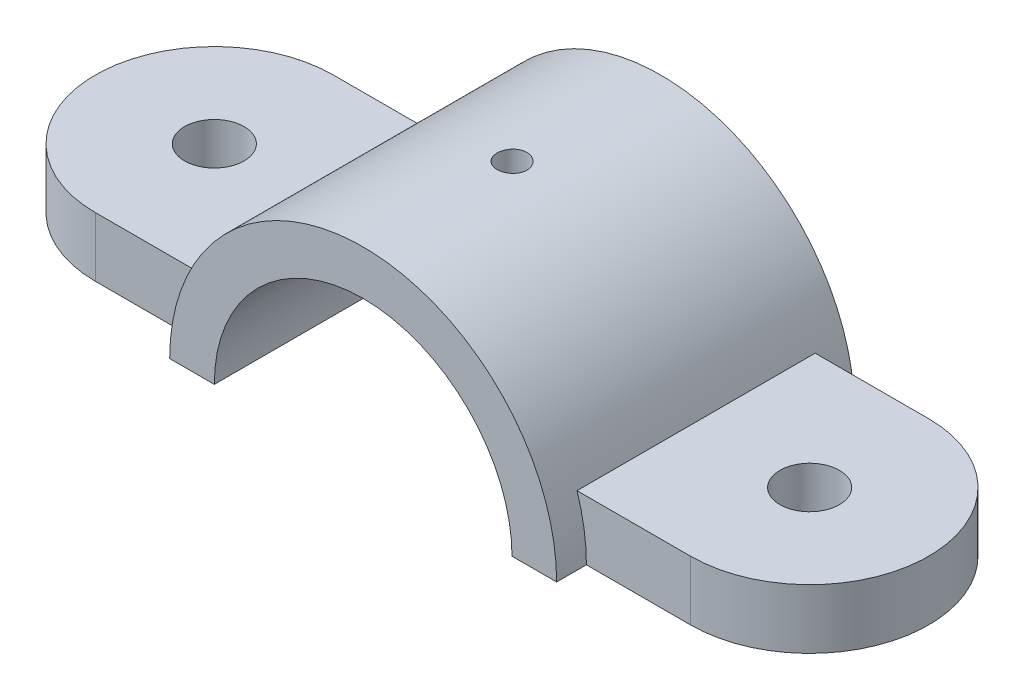
ISO-10303-21;
HEADER;
FILE_DESCRIPTION(('STEP AP214'),'2;1');
FILE_NAME('part.step','',(''),(''),'','','');
FILE_SCHEMA(('AUTOMOTIVE_DESIGN { 1 0 10303 214 1 1 1 1 }'));
ENDSEC;
DATA;
#1=APPLICATION_CONTEXT('core data for automotive mechanical design processes');
#2=APPLICATION_PROTOCOL_DEFINITION('international standard','automotive_design',2000,#1);
#3=PRODUCT_CONTEXT('',#1,'mechanical');
#4=PRODUCT('Part','Part','',(#3));
#5=PRODUCT_RELATED_PRODUCT_CATEGORY('part','',(#4));
#6=PRODUCT_DEFINITION_FORMATION('','',#4);
#7=PRODUCT_DEFINITION_CONTEXT('part definition',#1,'design');
#8=PRODUCT_DEFINITION('design','',#6,#7);
#9=PRODUCT_DEFINITION_SHAPE('','',#8);
#10=(LENGTH_UNIT() NAMED_UNIT(*) SI_UNIT(.MILLI.,.METRE.));
#11=(NAMED_UNIT(*) PLANE_ANGLE_UNIT() SI_UNIT($,.RADIAN.));
#12=(NAMED_UNIT(*) SI_UNIT($,.STERADIAN.) SOLID_ANGLE_UNIT());
#13=UNCERTAINTY_MEASURE_WITH_UNIT(LENGTH_MEASURE(1.E-05),#10,'distance_accuracy_value','');
#14=(GEOMETRIC_REPRESENTATION_CONTEXT(3) GLOBAL_UNCERTAINTY_ASSIGNED_CONTEXT((#13)) GLOBAL_UNIT_ASSIGNED_CONTEXT((#10,
#11,#12)) REPRESENTATION_CONTEXT('',''));
#15=CARTESIAN_POINT('',(0.,0.,0.));
#16=DIRECTION('',(0.,0.,1.));
#17=DIRECTION('',(1.,0.,0.));
#18=AXIS2_PLACEMENT_3D('',#15,#16,#17);
#19=CARTESIAN_POINT('',(-63.5,0.,0.));
#20=DIRECTION('',(0.,1.,0.));
#21=DIRECTION('',(0.,0.,1.));
#22=AXIS2_PLACEMENT_3D('',#19,#20,#21);
#23=PLANE('',#22);
#24=CARTESIAN_POINT('',(-63.5,0.,0.));
#25=DIRECTION('',(0.,1.,0.));
#26=DIRECTION('',(0.,0.,1.));
#27=AXIS2_PLACEMENT_3D('',#24,#25,#26);
#28=CIRCLE('',#27,6.35);
#29=CARTESIAN_POINT('',(-63.5,0.,6.35));
#30=VERTEX_POINT('',#29);
#31=EDGE_CURVE('E176',#30,#30,#28,.T.);
#32=ORIENTED_EDGE('',*,*,#31,.T.);
#33=EDGE_LOOP('',(#32));
#34=FACE_BOUND('',#33,.T.);
#35=DIRECTION('',(1.,0.,0.));
#36=VECTOR('',#35,1.);
#37=CARTESIAN_POINT('',(-41.275,0.,-31.75));
#38=LINE('',#37,#36);
#39=CARTESIAN_POINT('',(-41.275,0.,-31.75));
#40=VERTEX_POINT('',#39);
#41=CARTESIAN_POINT('',(-31.75,0.,-31.75));
#42=VERTEX_POINT('',#41);
#43=EDGE_CURVE('E151',#40,#42,#38,.T.);
#44=ORIENTED_EDGE('',*,*,#43,.T.);
#45=DIRECTION('',(0.,0.,1.));
#46=VECTOR('',#45,1.);
#47=CARTESIAN_POINT('',(-31.75,0.,-31.75));
#48=LINE('',#47,#46);
#49=CARTESIAN_POINT('',(-31.75,0.,31.75));
#50=VERTEX_POINT('',#49);
#51=EDGE_CURVE('E54',#42,#50,#48,.T.);
#52=ORIENTED_EDGE('',*,*,#51,.T.);
#53=DIRECTION('',(1.,0.,0.));
#54=VECTOR('',#53,1.);
#55=CARTESIAN_POINT('',(-41.275,0.,31.75));
#56=LINE('',#55,#54);
#57=CARTESIAN_POINT('',(-41.275,0.,31.75));
#58=VERTEX_POINT('',#57);
#59=EDGE_CURVE('E226',#58,#50,#56,.T.);
#60=ORIENTED_EDGE('',*,*,#59,.F.);
#61=DIRECTION('',(0.,0.,-1.));
#62=VECTOR('',#61,1.);
#63=CARTESIAN_POINT('',(-41.275,0.,31.75));
#64=LINE('',#63,#62);
#65=CARTESIAN_POINT('',(-41.275,0.,25.4));
#66=VERTEX_POINT('',#65);
#67=EDGE_CURVE('E162',#58,#66,#64,.T.);
#68=ORIENTED_EDGE('',*,*,#67,.T.);
#69=DIRECTION('',(1.,0.,0.));
#70=VECTOR('',#69,1.);
#71=CARTESIAN_POINT('',(-63.5,0.,25.4));
#72=LINE('',#71,#70);
#73=CARTESIAN_POINT('',(-63.5,0.,25.4));
#74=VERTEX_POINT('',#73);
#75=EDGE_CURVE('E202',#74,#66,#72,.T.);
#76=ORIENTED_EDGE('',*,*,#75,.F.);
#77=CARTESIAN_POINT('',(-63.5,0.,0.));
#78=DIRECTION('',(0.,1.,0.));
#79=DIRECTION('',(0.,0.,1.));
#80=AXIS2_PLACEMENT_3D('',#77,#78,#79);
#81=CIRCLE('',#80,25.4);
#82=CARTESIAN_POINT('',(-63.5,0.,-25.4));
#83=VERTEX_POINT('',#82);
#84=EDGE_CURVE('E182',#83,#74,#81,.T.);
#85=ORIENTED_EDGE('',*,*,#84,.F.);
#86=DIRECTION('',(-1.,0.,0.));
#87=VECTOR('',#86,1.);
#88=CARTESIAN_POINT('',(-63.5,0.,-25.4));
#89=LINE('',#88,#87);
#90=CARTESIAN_POINT('',(-41.275,0.,-25.4));
#91=VERTEX_POINT('',#90);
#92=EDGE_CURVE('E206',#91,#83,#89,.T.);
#93=ORIENTED_EDGE('',*,*,#92,.F.);
#94=EDGE_CURVE('E160',#91,#40,#64,.T.);
#95=ORIENTED_EDGE('',*,*,#94,.T.);
#96=EDGE_LOOP('',(#44,#52,#60,#68,#76,#85,#93,#95));
#97=FACE_BOUND('',#96,.T.);
#98=ADVANCED_FACE('F33',(#34,#97),#23,.F.);
#99=CARTESIAN_POINT('',(-63.5,12.7,0.));
#100=DIRECTION('',(0.,1.,0.));
#101=DIRECTION('',(0.,0.,1.));
#102=AXIS2_PLACEMENT_3D('',#99,#100,#101);
#103=PLANE('',#102);
#104=CARTESIAN_POINT('',(63.5,12.7,0.));
#105=DIRECTION('',(0.,1.,0.));
#106=DIRECTION('',(0.,0.,1.));
#107=AXIS2_PLACEMENT_3D('',#104,#105,#106);
#108=CIRCLE('',#107,6.35);
#109=CARTESIAN_POINT('',(63.5,12.7,6.35));
#110=VERTEX_POINT('',#109);
#111=EDGE_CURVE('E179',#110,#110,#108,.T.);
#112=ORIENTED_EDGE('',*,*,#111,.F.);
#113=EDGE_LOOP('',(#112));
#114=FACE_BOUND('',#113,.T.);
#115=DIRECTION('',(-1.,0.,0.));
#116=VECTOR('',#115,1.);
#117=CARTESIAN_POINT('',(-63.5,12.7,-25.4));
#118=LINE('',#117,#116);
#119=CARTESIAN_POINT('',(63.5,12.7,-25.4));
#120=VERTEX_POINT('',#119);
#121=CARTESIAN_POINT('',(39.2725810840082,12.7,-25.4));
#122=VERTEX_POINT('',#121);
#123=EDGE_CURVE('E196',#120,#122,#118,.T.);
#124=ORIENTED_EDGE('',*,*,#123,.T.);
#125=DIRECTION('',(0.,0.,-1.));
#126=VECTOR('',#125,1.);
#127=CARTESIAN_POINT('',(39.2725810840082,12.7,31.75));
#128=LINE('',#127,#126);
#129=CARTESIAN_POINT('',(39.2725810840082,12.7,25.4));
#130=VERTEX_POINT('',#129);
#131=EDGE_CURVE('E62',#122,#130,#128,.F.);
#132=ORIENTED_EDGE('',*,*,#131,.T.);
#133=DIRECTION('',(1.,0.,0.));
#134=VECTOR('',#133,1.);
#135=CARTESIAN_POINT('',(-63.5,12.7,25.4));
#136=LINE('',#135,#134);
#137=CARTESIAN_POINT('',(63.5,12.7,25.4));
#138=VERTEX_POINT('',#137);
#139=EDGE_CURVE('E188',#130,#138,#136,.T.);
#140=ORIENTED_EDGE('',*,*,#139,.T.);
#141=CARTESIAN_POINT('',(63.5,12.7,0.));
#142=DIRECTION('',(0.,1.,0.));
#143=DIRECTION('',(0.,0.,1.));
#144=AXIS2_PLACEMENT_3D('',#141,#142,#143);
#145=CIRCLE('',#144,25.4);
#146=EDGE_CURVE('E193',#138,#120,#145,.T.);
#147=ORIENTED_EDGE('',*,*,#146,.T.);
#148=EDGE_LOOP('',(#124,#132,#140,#147));
#149=FACE_BOUND('',#148,.T.);
#150=ADVANCED_FACE('F258',(#114,#149),#103,.T.);
#151=CARTESIAN_POINT('',(-63.5,12.7,0.));
#152=DIRECTION('',(0.,1.,0.));
#153=DIRECTION('',(0.,0.,1.));
#154=AXIS2_PLACEMENT_3D('',#151,#152,#153);
#155=CIRCLE('',#154,6.35);
#156=CARTESIAN_POINT('',(-63.5,12.7,6.35));
#157=VERTEX_POINT('',#156);
#158=EDGE_CURVE('E172',#157,#157,#155,.T.);
#159=ORIENTED_EDGE('',*,*,#158,.F.);
#160=EDGE_LOOP('',(#159));
#161=FACE_BOUND('',#160,.T.);
#162=CARTESIAN_POINT('',(-63.5,12.7,25.4));
#163=VERTEX_POINT('',#162);
#164=CARTESIAN_POINT('',(-39.2725810840082,12.7,25.4));
#165=VERTEX_POINT('',#164);
#166=EDGE_CURVE('E190',#163,#165,#136,.T.);
#167=ORIENTED_EDGE('',*,*,#166,.T.);
#168=DIRECTION('',(0.,0.,-1.));
#169=VECTOR('',#168,1.);
#170=CARTESIAN_POINT('',(-39.2725810840082,12.7,31.75));
#171=LINE('',#170,#169);
#172=CARTESIAN_POINT('',(-39.2725810840082,12.7,-25.4));
#173=VERTEX_POINT('',#172);
#174=EDGE_CURVE('E169',#165,#173,#171,.T.);
#175=ORIENTED_EDGE('',*,*,#174,.T.);
#176=CARTESIAN_POINT('',(-63.5,12.7,-25.4));
#177=VERTEX_POINT('',#176);
#178=EDGE_CURVE('E195',#173,#177,#118,.T.);
#179=ORIENTED_EDGE('',*,*,#178,.T.);
#180=CARTESIAN_POINT('',(-63.5,12.7,0.));
#181=DIRECTION('',(0.,1.,0.));
#182=DIRECTION('',(0.,0.,1.));
#183=AXIS2_PLACEMENT_3D('',#180,#181,#182);
#184=CIRCLE('',#183,25.4);
#185=EDGE_CURVE('E185',#177,#163,#184,.T.);
#186=ORIENTED_EDGE('',*,*,#185,.T.);
#187=EDGE_LOOP('',(#167,#175,#179,#186));
#188=FACE_BOUND('',#187,.T.);
#189=ADVANCED_FACE('F264',(#161,#188),#103,.T.);
#190=CARTESIAN_POINT('',(-63.5,12.7,25.4));
#191=DIRECTION('',(0.,0.,-1.));
#192=DIRECTION('',(-1.,0.,0.));
#193=AXIS2_PLACEMENT_3D('',#190,#191,#192);
#194=PLANE('',#193);
#195=CARTESIAN_POINT('',(0.,0.,25.4));
#196=DIRECTION('',(0.,0.,-1.));
#197=DIRECTION('',(-1.,0.,0.));
#198=AXIS2_PLACEMENT_3D('',#195,#196,#197);
#199=CIRCLE('',#198,41.275);
#200=CARTESIAN_POINT('',(41.275,0.,25.4));
#201=VERTEX_POINT('',#200);
#202=EDGE_CURVE('E166',#201,#130,#199,.F.);
#203=ORIENTED_EDGE('',*,*,#202,.F.);
#204=CARTESIAN_POINT('',(63.5,0.,25.4));
#205=VERTEX_POINT('',#204);
#206=EDGE_CURVE('E201',#201,#205,#72,.T.);
#207=ORIENTED_EDGE('',*,*,#206,.T.);
#208=DIRECTION('',(0.,-1.,0.));
#209=VECTOR('',#208,1.);
#210=CARTESIAN_POINT('',(63.5,12.7,25.4));
#211=LINE('',#210,#209);
#212=EDGE_CURVE('E213',#138,#205,#211,.T.);
#213=ORIENTED_EDGE('',*,*,#212,.F.);
#214=ORIENTED_EDGE('',*,*,#139,.F.);
#215=EDGE_LOOP('',(#203,#207,#213,#214));
#216=FACE_BOUND('',#215,.T.);
#217=ADVANCED_FACE('F287',(#216),#194,.F.);
#218=EDGE_CURVE('E170',#165,#66,#199,.F.);
#219=ORIENTED_EDGE('',*,*,#218,.F.);
#220=ORIENTED_EDGE('',*,*,#166,.F.);
#221=DIRECTION('',(0.,-1.,0.));
#222=VECTOR('',#221,1.);
#223=CARTESIAN_POINT('',(-63.5,12.7,25.4));
#224=LINE('',#223,#222);
#225=EDGE_CURVE('E216',#163,#74,#224,.T.);
#226=ORIENTED_EDGE('',*,*,#225,.T.);
#227=ORIENTED_EDGE('',*,*,#75,.T.);
#228=EDGE_LOOP('',(#219,#220,#226,#227));
#229=FACE_BOUND('',#228,.T.);
#230=ADVANCED_FACE('F281',(#229),#194,.F.);
#231=CARTESIAN_POINT('',(-63.5,12.7,-25.4));
#232=DIRECTION('',(0.,0.,1.));
#233=DIRECTION('',(1.,0.,0.));
#234=AXIS2_PLACEMENT_3D('',#231,#232,#233);
#235=PLANE('',#234);
#236=CARTESIAN_POINT('',(0.,0.,-25.4));
#237=DIRECTION('',(0.,0.,1.));
#238=DIRECTION('',(1.,0.,0.));
#239=AXIS2_PLACEMENT_3D('',#236,#237,#238);
#240=CIRCLE('',#239,41.275);
#241=EDGE_CURVE('E11',#91,#173,#240,.F.);
#242=ORIENTED_EDGE('',*,*,#241,.F.);
#243=ORIENTED_EDGE('',*,*,#92,.T.);
#244=DIRECTION('',(0.,-1.,0.));
#245=VECTOR('',#244,1.);
#246=CARTESIAN_POINT('',(-63.5,12.7,-25.4));
#247=LINE('',#246,#245);
#248=EDGE_CURVE('E198',#177,#83,#247,.T.);
#249=ORIENTED_EDGE('',*,*,#248,.F.);
#250=ORIENTED_EDGE('',*,*,#178,.F.);
#251=EDGE_LOOP('',(#242,#243,#249,#250));
#252=FACE_BOUND('',#251,.T.);
#253=ADVANCED_FACE('F277',(#252),#235,.F.);
#254=CARTESIAN_POINT('',(41.275,0.,-25.4));
#255=VERTEX_POINT('',#254);
#256=EDGE_CURVE('E47',#122,#255,#240,.F.);
#257=ORIENTED_EDGE('',*,*,#256,.F.);
#258=ORIENTED_EDGE('',*,*,#123,.F.);
#259=DIRECTION('',(0.,-1.,0.));
#260=VECTOR('',#259,1.);
#261=CARTESIAN_POINT('',(63.5,12.7,-25.4));
#262=LINE('',#261,#260);
#263=CARTESIAN_POINT('',(63.5,0.,-25.4));
#264=VERTEX_POINT('',#263);
#265=EDGE_CURVE('E210',#120,#264,#262,.T.);
#266=ORIENTED_EDGE('',*,*,#265,.T.);
#267=EDGE_CURVE('E189',#264,#255,#89,.T.);
#268=ORIENTED_EDGE('',*,*,#267,.T.);
#269=EDGE_LOOP('',(#257,#258,#266,#268));
#270=FACE_BOUND('',#269,.T.);
#271=ADVANCED_FACE('F270',(#270),#235,.F.);
#272=CARTESIAN_POINT('',(31.75,0.,31.75));
#273=VERTEX_POINT('',#272);
#274=CARTESIAN_POINT('',(41.275,0.,31.75));
#275=VERTEX_POINT('',#274);
#276=EDGE_CURVE('E145',#273,#275,#56,.T.);
#277=ORIENTED_EDGE('',*,*,#276,.F.);
#278=DIRECTION('',(0.,0.,1.));
#279=VECTOR('',#278,1.);
#280=CARTESIAN_POINT('',(31.75,0.,-31.75));
#281=LINE('',#280,#279);
#282=CARTESIAN_POINT('',(31.75,0.,-31.75));
#283=VERTEX_POINT('',#282);
#284=EDGE_CURVE('E129',#283,#273,#281,.T.);
#285=ORIENTED_EDGE('',*,*,#284,.F.);
#286=CARTESIAN_POINT('',(41.275,0.,-31.75));
#287=VERTEX_POINT('',#286);
#288=EDGE_CURVE('E142',#283,#287,#38,.T.);
#289=ORIENTED_EDGE('',*,*,#288,.T.);
#290=DIRECTION('',(0.,0.,-1.));
#291=VECTOR('',#290,1.);
#292=CARTESIAN_POINT('',(41.275,0.,31.75));
#293=LINE('',#292,#291);
#294=EDGE_CURVE('E161',#255,#287,#293,.T.);
#295=ORIENTED_EDGE('',*,*,#294,.F.);
#296=ORIENTED_EDGE('',*,*,#267,.F.);
#297=CARTESIAN_POINT('',(63.5,0.,0.));
#298=DIRECTION('',(0.,1.,0.));
#299=DIRECTION('',(0.,0.,1.));
#300=AXIS2_PLACEMENT_3D('',#297,#298,#299);
#301=CIRCLE('',#300,25.4);
#302=EDGE_CURVE('E204',#205,#264,#301,.T.);
#303=ORIENTED_EDGE('',*,*,#302,.F.);
#304=ORIENTED_EDGE('',*,*,#206,.F.);
#305=EDGE_CURVE('E157',#275,#201,#293,.T.);
#306=ORIENTED_EDGE('',*,*,#305,.F.);
#307=EDGE_LOOP('',(#277,#285,#289,#295,#296,#303,#304,#306));
#308=FACE_BOUND('',#307,.T.);
#309=CARTESIAN_POINT('',(63.5,0.,0.));
#310=DIRECTION('',(0.,1.,0.));
#311=DIRECTION('',(0.,0.,1.));
#312=AXIS2_PLACEMENT_3D('',#309,#310,#311);
#313=CIRCLE('',#312,6.35);
#314=CARTESIAN_POINT('',(63.5,0.,6.35));
#315=VERTEX_POINT('',#314);
#316=EDGE_CURVE('E175',#315,#315,#313,.T.);
#317=ORIENTED_EDGE('',*,*,#316,.T.);
#318=EDGE_LOOP('',(#317));
#319=FACE_BOUND('',#318,.T.);
#320=ADVANCED_FACE('F139',(#308,#319),#23,.F.);
#321=CARTESIAN_POINT('',(-63.5,12.7,0.));
#322=DIRECTION('',(0.,-1.,0.));
#323=DIRECTION('',(0.,0.,-1.));
#324=AXIS2_PLACEMENT_3D('',#321,#322,#323);
#325=CYLINDRICAL_SURFACE('',#324,25.4);
#326=ORIENTED_EDGE('',*,*,#84,.T.);
#327=ORIENTED_EDGE('',*,*,#225,.F.);
#328=ORIENTED_EDGE('',*,*,#185,.F.);
#329=ORIENTED_EDGE('',*,*,#248,.T.);
#330=EDGE_LOOP('',(#326,#327,#328,#329));
#331=FACE_BOUND('',#330,.T.);
#332=ADVANCED_FACE('F35',(#331),#325,.T.);
#333=CARTESIAN_POINT('',(63.5,12.7,0.));
#334=DIRECTION('',(0.,-1.,0.));
#335=DIRECTION('',(0.,0.,-1.));
#336=AXIS2_PLACEMENT_3D('',#333,#334,#335);
#337=CYLINDRICAL_SURFACE('',#336,25.4);
#338=ORIENTED_EDGE('',*,*,#302,.T.);
#339=ORIENTED_EDGE('',*,*,#265,.F.);
#340=ORIENTED_EDGE('',*,*,#146,.F.);
#341=ORIENTED_EDGE('',*,*,#212,.T.);
#342=EDGE_LOOP('',(#338,#339,#340,#341));
#343=FACE_BOUND('',#342,.T.);
#344=ADVANCED_FACE('F275',(#343),#337,.T.);
#345=CARTESIAN_POINT('',(63.5,12.7,0.));
#346=DIRECTION('',(0.,-1.,0.));
#347=DIRECTION('',(0.,0.,-1.));
#348=AXIS2_PLACEMENT_3D('',#345,#346,#347);
#349=CYLINDRICAL_SURFACE('',#348,6.35);
#350=ORIENTED_EDGE('',*,*,#111,.T.);
#351=EDGE_LOOP('',(#350));
#352=FACE_BOUND('',#351,.T.);
#353=ORIENTED_EDGE('',*,*,#316,.F.);
#354=EDGE_LOOP('',(#353));
#355=FACE_BOUND('',#354,.T.);
#356=ADVANCED_FACE('F285',(#352,#355),#349,.F.);
#357=CARTESIAN_POINT('',(-63.5,12.7,0.));
#358=DIRECTION('',(0.,-1.,0.));
#359=DIRECTION('',(0.,0.,-1.));
#360=AXIS2_PLACEMENT_3D('',#357,#358,#359);
#361=CYLINDRICAL_SURFACE('',#360,6.35);
#362=ORIENTED_EDGE('',*,*,#158,.T.);
#363=EDGE_LOOP('',(#362));
#364=FACE_BOUND('',#363,.T.);
#365=ORIENTED_EDGE('',*,*,#31,.F.);
#366=EDGE_LOOP('',(#365));
#367=FACE_BOUND('',#366,.T.);
#368=ADVANCED_FACE('F316',(#364,#367),#361,.F.);
#369=CARTESIAN_POINT('',(0.,0.,31.75));
#370=DIRECTION('',(0.,0.,-1.));
#371=DIRECTION('',(-1.,0.,0.));
#372=AXIS2_PLACEMENT_3D('',#369,#370,#371);
#373=CYLINDRICAL_SURFACE('',#372,41.275);
#374=CARTESIAN_POINT('',(-3.175,41.1527034348899,0.));
#375=CARTESIAN_POINT('',(-3.17499220166869,41.1527050606603,-0.178057854376646));
#376=CARTESIAN_POINT('',(-3.15997107669077,41.1538714916188,-0.356238097689488));
#377=CARTESIAN_POINT('',(-3.10026817646274,41.1584113385913,-0.707671960235022));
#378=CARTESIAN_POINT('',(-3.05555248356724,41.1617872782803,-0.880919709224935));
#379=CARTESIAN_POINT('',(-2.93775832709765,41.1703615188243,-1.21734756427386));
#380=CARTESIAN_POINT('',(-2.86469556833233,41.1755588104618,-1.38053318702576));
#381=CARTESIAN_POINT('',(-2.69230837748994,41.1871888802629,-1.69228427339407));
#382=CARTESIAN_POINT('',(-2.59298969446218,41.1936213878768,-1.84085292781095));
#383=CARTESIAN_POINT('',(-2.37067224065683,41.2070130762923,-2.11952083078185));
#384=CARTESIAN_POINT('',(-2.24762756050522,41.2139732620341,-2.24958340839374));
#385=CARTESIAN_POINT('',(-1.981447462887,41.2276268223411,-2.48723244686588));
#386=CARTESIAN_POINT('',(-1.83831118171097,41.23432018542,-2.59481794097318));
#387=CARTESIAN_POINT('',(-1.53579536459097,41.2466952360859,-2.78457840616891));
#388=CARTESIAN_POINT('',(-1.37639610097473,41.2523756714488,-2.86672201606357));
#389=CARTESIAN_POINT('',(-1.04601692199708,41.2620740640571,-3.0030663230651));
#390=CARTESIAN_POINT('',(-0.875037182711653,41.2660920465727,-3.05726744491724));
#391=CARTESIAN_POINT('',(-0.526712536594909,41.2720058107759,-3.13608365540832));
#392=CARTESIAN_POINT('',(-0.349381017227653,41.273905812788,-3.16075758768065));
#393=CARTESIAN_POINT('',(0.0069160010602208,41.2753838129443,-3.18000086164783));
#394=CARTESIAN_POINT('',(0.1858814735892,41.2749618485268,-3.17457068872889));
#395=CARTESIAN_POINT('',(0.539967380231742,41.2718469543422,-3.13380815055782));
#396=CARTESIAN_POINT('',(0.715095147555189,41.2691588306631,-3.09853906733204));
#397=CARTESIAN_POINT('',(1.0569376403925,41.2618195944261,-2.99919820139733));
#398=CARTESIAN_POINT('',(1.22365229595613,41.25716846555,-2.93512617925228));
#399=CARTESIAN_POINT('',(1.54413813127582,41.246418342797,-2.77992729268081));
#400=CARTESIAN_POINT('',(1.69789547819955,41.2403178274747,-2.68877197309452));
#401=CARTESIAN_POINT('',(1.98795108878021,41.2273548394594,-2.48201472572838));
#402=CARTESIAN_POINT('',(2.12424905147447,41.2204923536355,-2.36641237662472));
#403=CARTESIAN_POINT('',(2.37588667804211,41.2067560458888,-2.11368568313588));
#404=CARTESIAN_POINT('',(2.4911711450359,41.1998822406404,-1.97650637168976));
#405=CARTESIAN_POINT('',(2.69708313329331,41.1869159589129,-1.68471166926316));
#406=CARTESIAN_POINT('',(2.7877106383211,41.1808234829483,-1.53009626680165));
#407=CARTESIAN_POINT('',(2.94173340273896,41.170108333191,-1.20778082695543));
#408=CARTESIAN_POINT('',(3.00512598020191,41.1654858041611,-1.04007950287065));
#409=CARTESIAN_POINT('',(3.10283947696446,41.1582365243551,-0.696370316188069));
#410=CARTESIAN_POINT('',(3.13716091601422,41.155609737898,-0.520362602155977));
#411=CARTESIAN_POINT('',(3.17568837621723,41.1526549368992,-0.165519327146655));
#412=CARTESIAN_POINT('',(3.17997128694765,41.1523210532632,0.0133078386871818));
#413=CARTESIAN_POINT('',(3.1585013512759,41.1539743600837,0.369137731946895));
#414=CARTESIAN_POINT('',(3.13274874302089,41.1559615321369,0.546140473827131));
#415=CARTESIAN_POINT('',(3.0520028139329,41.1620276817979,0.893077447050421));
#416=CARTESIAN_POINT('',(2.99704521642116,41.1661041036352,1.06302004108955));
#417=CARTESIAN_POINT('',(2.85948562238432,41.1758872894205,1.39127141147897));
#418=CARTESIAN_POINT('',(2.77688324702062,41.1815940757105,1.54958002836327));
#419=CARTESIAN_POINT('',(2.58618366102358,41.1940091890744,1.8504219525167));
#420=CARTESIAN_POINT('',(2.47803511709162,41.2007195226162,1.99292263627154));
#421=CARTESIAN_POINT('',(2.23938746426201,41.214378755623,2.25777426999692));
#422=CARTESIAN_POINT('',(2.10888802704816,41.2213276585912,2.38012492392835));
#423=CARTESIAN_POINT('',(1.82891117199028,41.2346984243859,2.60146494337141));
#424=CARTESIAN_POINT('',(1.67939425135849,41.2411191430053,2.70040441969703));
#425=CARTESIAN_POINT('',(1.36582409432317,41.2526936264287,2.87177156703721));
#426=CARTESIAN_POINT('',(1.20177098461393,41.2578474022735,2.94419946909272));
#427=CARTESIAN_POINT('',(0.863965646879877,41.2663019859796,3.06040145087377));
#428=CARTESIAN_POINT('',(0.690224167372419,41.2696048040768,3.10420662498181));
#429=CARTESIAN_POINT('',(0.3378258815466,41.2739934522312,3.16202135498785));
#430=CARTESIAN_POINT('',(0.15916915318754,41.2750793174303,3.17603138318216));
#431=CARTESIAN_POINT('',(-0.197495810085342,41.2749117865558,3.17385296820318));
#432=CARTESIAN_POINT('',(-0.375504528557382,41.2736644214845,3.15774238173217));
#433=CARTESIAN_POINT('',(-0.72628053939218,41.2689825536727,3.09594210535579));
#434=CARTESIAN_POINT('',(-0.899047823825417,41.2655480476237,3.05025237070384));
#435=CARTESIAN_POINT('',(-1.23444386706542,41.2568774693415,2.93060987523341));
#436=CARTESIAN_POINT('',(-1.39707300937173,41.2516414653032,2.85665818424672));
#437=CARTESIAN_POINT('',(-1.70761940927438,41.2399543793655,2.68260033884079));
#438=CARTESIAN_POINT('',(-1.85553694945964,41.2335033208125,2.5824946869359));
#439=CARTESIAN_POINT('',(-2.13285907631228,41.2200908848677,2.35867899335029));
#440=CARTESIAN_POINT('',(-2.26221732931159,41.2131282937014,2.23491161480417));
#441=CARTESIAN_POINT('',(-2.49837253637369,41.1994877559882,1.96738348791059));
#442=CARTESIAN_POINT('',(-2.60516400026979,41.1928098790227,1.82361788836579));
#443=CARTESIAN_POINT('',(-2.79327622028498,41.180482778899,1.51993461092238));
#444=CARTESIAN_POINT('',(-2.87455450016988,41.1748352776625,1.35999057707788));
#445=CARTESIAN_POINT('',(-3.00899959885699,41.1652296441394,1.02879390173509));
#446=CARTESIAN_POINT('',(-3.0621989423127,41.1612695582997,0.857554603785274));
#447=CARTESIAN_POINT('',(-3.12533252495933,41.1565121743173,0.571076747413939));
#448=CARTESIAN_POINT('',(-3.14393329891333,41.1550904004063,0.457683987129222));
#449=CARTESIAN_POINT('',(-3.16876953653846,41.1531855076536,0.22954444016361));
#450=CARTESIAN_POINT('',(-3.17500502774878,41.1527023867214,0.114797656498886));
#451=CARTESIAN_POINT('',(-3.175,41.1527034348899,0.));
#452=B_SPLINE_CURVE_WITH_KNOTS('',3,(#374,#375,#376,#377,#378,#379,#380,#381,#382,#383,#384,
#385,#386,#387,#388,#389,#390,#391,#392,#393,#394,#395,#396,#397,#398,#399,#400,#401,#402,#403,
#404,#405,#406,#407,#408,#409,#410,#411,#412,#413,#414,#415,#416,#417,#418,#419,#420,#421,#422,
#423,#424,#425,#426,#427,#428,#429,#430,#431,#432,#433,#434,#435,#436,#437,#438,#439,#440,#441,
#442,#443,#444,#445,#446,#447,#448,#449,#450,#451),.UNSPECIFIED.,.T.,.F.,(4,2,2,2,2,2,2,2,2,2,2,
2,2,2,2,2,2,2,2,2,2,2,2,2,2,2,2,2,2,2,2,2,2,2,2,2,2,2,4),(0.,0.533754437856523,1.0681195902429,
1.60218911603477,2.13614179762287,2.67113822834807,3.20615766485819,3.74183399759192,
4.27750218743267,4.81210107688326,5.34669134670632,5.88015069730578,6.41361448258474,
6.94764074745815,7.48167621657102,8.01709485197686,8.55251383993816,9.08798554056939,
9.62344766753455,10.1575386709955,10.6916254397574,11.2250604163119,11.7585027032535,
12.2930261644559,12.8275574780409,13.3632178201325,13.8988734939832,14.4339462849869,
14.9690105942472,15.5026937644113,16.0363777419193,16.5700415192846,17.1036950437483,
17.6386584896903,18.1737519348845,18.7097315753032,19.245089004709,19.5892125217082,
19.9333352722957),.UNSPECIFIED.);
#453=CARTESIAN_POINT('',(-3.175,41.1527034348899,0.));
#454=VERTEX_POINT('',#453);
#455=EDGE_CURVE('E233',#454,#454,#452,.T.);
#456=ORIENTED_EDGE('',*,*,#455,.T.);
#457=EDGE_LOOP('',(#456));
#458=FACE_BOUND('',#457,.T.);
#459=ORIENTED_EDGE('',*,*,#174,.F.);
#460=ORIENTED_EDGE('',*,*,#218,.T.);
#461=ORIENTED_EDGE('',*,*,#67,.F.);
#462=CARTESIAN_POINT('',(0.,0.,31.75));
#463=DIRECTION('',(0.,0.,1.));
#464=DIRECTION('',(-1.,0.,0.));
#465=AXIS2_PLACEMENT_3D('',#462,#463,#464);
#466=CIRCLE('',#465,41.275);
#467=EDGE_CURVE('E153',#275,#58,#466,.T.);
#468=ORIENTED_EDGE('',*,*,#467,.F.);
#469=ORIENTED_EDGE('',*,*,#305,.T.);
#470=ORIENTED_EDGE('',*,*,#202,.T.);
#471=ORIENTED_EDGE('',*,*,#131,.F.);
#472=ORIENTED_EDGE('',*,*,#256,.T.);
#473=ORIENTED_EDGE('',*,*,#294,.T.);
#474=CARTESIAN_POINT('',(0.,0.,-31.75));
#475=DIRECTION('',(0.,0.,1.));
#476=DIRECTION('',(-1.,0.,0.));
#477=AXIS2_PLACEMENT_3D('',#474,#475,#476);
#478=CIRCLE('',#477,41.275);
#479=EDGE_CURVE('E146',#287,#40,#478,.T.);
#480=ORIENTED_EDGE('',*,*,#479,.T.);
#481=ORIENTED_EDGE('',*,*,#94,.F.);
#482=ORIENTED_EDGE('',*,*,#241,.T.);
#483=EDGE_LOOP('',(#459,#460,#461,#468,#469,#470,#471,#472,#473,#480,#481,#482));
#484=FACE_BOUND('',#483,.T.);
#485=ADVANCED_FACE('F221',(#458,#484),#373,.T.);
#486=CARTESIAN_POINT('',(0.,0.,31.75));
#487=DIRECTION('',(0.,0.,-1.));
#488=DIRECTION('',(-1.,0.,0.));
#489=AXIS2_PLACEMENT_3D('',#486,#487,#488);
#490=PLANE('',#489);
#491=ORIENTED_EDGE('',*,*,#59,.T.);
#492=CARTESIAN_POINT('',(0.,0.,31.75));
#493=DIRECTION('',(0.,0.,1.));
#494=DIRECTION('',(-1.,0.,0.));
#495=AXIS2_PLACEMENT_3D('',#492,#493,#494);
#496=CIRCLE('',#495,31.75);
#497=EDGE_CURVE('E135',#273,#50,#496,.T.);
#498=ORIENTED_EDGE('',*,*,#497,.F.);
#499=ORIENTED_EDGE('',*,*,#276,.T.);
#500=ORIENTED_EDGE('',*,*,#467,.T.);
#501=EDGE_LOOP('',(#491,#498,#499,#500));
#502=FACE_BOUND('',#501,.T.);
#503=ADVANCED_FACE('F252',(#502),#490,.F.);
#504=CARTESIAN_POINT('',(0.,0.,-31.75));
#505=DIRECTION('',(0.,0.,-1.));
#506=DIRECTION('',(-1.,0.,0.));
#507=AXIS2_PLACEMENT_3D('',#504,#505,#506);
#508=PLANE('',#507);
#509=CARTESIAN_POINT('',(0.,0.,-31.75));
#510=DIRECTION('',(0.,0.,1.));
#511=DIRECTION('',(-1.,0.,0.));
#512=AXIS2_PLACEMENT_3D('',#509,#510,#511);
#513=CIRCLE('',#512,31.75);
#514=EDGE_CURVE('E126',#283,#42,#513,.T.);
#515=ORIENTED_EDGE('',*,*,#514,.T.);
#516=ORIENTED_EDGE('',*,*,#43,.F.);
#517=ORIENTED_EDGE('',*,*,#479,.F.);
#518=ORIENTED_EDGE('',*,*,#288,.F.);
#519=EDGE_LOOP('',(#515,#516,#517,#518));
#520=FACE_BOUND('',#519,.T.);
#521=ADVANCED_FACE('F149',(#520),#508,.T.);
#522=CARTESIAN_POINT('',(0.,0.,-31.75));
#523=DIRECTION('',(0.,0.,1.));
#524=DIRECTION('',(1.,0.,0.));
#525=AXIS2_PLACEMENT_3D('',#522,#523,#524);
#526=CYLINDRICAL_SURFACE('',#525,31.75);
#527=CARTESIAN_POINT('',(-3.175,31.5908511281352,0.));
#528=CARTESIAN_POINT('',(-3.17499229552397,31.5908532135596,0.177862116258071));
#529=CARTESIAN_POINT('',(-3.16000402726572,31.5923694083626,0.355841834728279));
#530=CARTESIAN_POINT('',(-3.10043929937069,31.5982695287188,0.706866716501139));
#531=CARTESIAN_POINT('',(-3.05583023226408,31.6026566145584,0.879906222272837));
#532=CARTESIAN_POINT('',(-2.93833586852023,31.6137967245895,1.21591647601009));
#533=CARTESIAN_POINT('',(-2.8654677142335,31.6205483142003,1.37889325881601));
#534=CARTESIAN_POINT('',(-2.69355654896638,31.6356549330656,1.69026774052812));
#535=CARTESIAN_POINT('',(-2.59451873661222,31.6440096437684,1.83866832698629));
#536=CARTESIAN_POINT('',(-2.37269261934599,31.6614151730634,2.11725276211207));
#537=CARTESIAN_POINT('',(-2.24982855249375,31.6704681551737,2.24737615517438));
#538=CARTESIAN_POINT('',(-1.98399944613959,31.6882305412276,2.48519190858646));
#539=CARTESIAN_POINT('',(-1.84103348742835,31.6969399294363,2.59288324261507));
#540=CARTESIAN_POINT('',(-1.53868869824189,31.7130551651922,2.78298674099767));
#541=CARTESIAN_POINT('',(-1.37927607853139,31.7204582409055,2.86534542116988));
#542=CARTESIAN_POINT('',(-1.04879770011285,31.7331031858052,3.00210357524708));
#543=CARTESIAN_POINT('',(-0.877732225571596,31.7383451076717,3.05650373067306));
#544=CARTESIAN_POINT('',(-0.529414685208868,31.7460619386302,3.13562336219656));
#545=CARTESIAN_POINT('',(-0.352185373325273,31.7485460990095,3.16044209398108));
#546=CARTESIAN_POINT('',(0.00393935168739218,31.7504989702585,3.18000147949955));
#547=CARTESIAN_POINT('',(0.182834721497912,31.7499677593124,3.17474291309442));
#548=CARTESIAN_POINT('',(0.536539579904976,31.7459573141302,3.13437754933575));
#549=CARTESIAN_POINT('',(0.711361385043556,31.7424886215669,3.09937748308465));
#550=CARTESIAN_POINT('',(1.05263689492689,31.7330051541615,3.00068891559448));
#551=CARTESIAN_POINT('',(1.21909049094079,31.7269903462465,2.93700004169946));
#552=CARTESIAN_POINT('',(1.53924099910768,31.7130727651143,2.78262472666716));
#553=CARTESIAN_POINT('',(1.69291498786674,31.7051666938628,2.69189105534175));
#554=CARTESIAN_POINT('',(1.98289390432806,31.6883537084912,2.48603603840703));
#555=CARTESIAN_POINT('',(2.11919832243062,31.6794467650212,2.37091397753905));
#556=CARTESIAN_POINT('',(2.37119405053703,31.6615855676043,2.11894982129417));
#557=CARTESIAN_POINT('',(2.48679254415434,31.6526312771936,1.98201488044549));
#558=CARTESIAN_POINT('',(2.69337642476138,31.6357234927211,1.69063395295578));
#559=CARTESIAN_POINT('',(2.78436177604842,31.6277700001109,1.53618794091445));
#560=CARTESIAN_POINT('',(2.93913618602,31.6137635920742,1.21409769499066));
#561=CARTESIAN_POINT('',(3.00291951031914,31.6077110774586,1.04645068705733));
#562=CARTESIAN_POINT('',(3.10140583564934,31.5982001344023,0.702752580348362));
#563=CARTESIAN_POINT('',(3.13610972263413,31.5947416269311,0.526701737782362));
#564=CARTESIAN_POINT('',(3.17533266186947,31.5908239317455,0.17200822999381));
#565=CARTESIAN_POINT('',(3.17998156435489,31.5903518416364,-0.0066199393408481));
#566=CARTESIAN_POINT('',(3.15930358381657,31.592426380514,-0.362112768987593));
#567=CARTESIAN_POINT('',(3.13397710582596,31.5949729687117,-0.538977453095669));
#568=CARTESIAN_POINT('',(3.05417592906137,31.6027861854113,-0.885544273733735));
#569=CARTESIAN_POINT('',(2.99976262882478,31.6080470835427,-1.05526068822554));
#570=CARTESIAN_POINT('',(2.8633950849711,31.6206914904817,-1.38315716424372));
#571=CARTESIAN_POINT('',(2.78144021048789,31.6280750479103,-1.5413369614118));
#572=CARTESIAN_POINT('',(2.59199062951871,31.6441640532939,-1.84226191754136));
#573=CARTESIAN_POINT('',(2.48440987699419,31.6528739183658,-1.98495266574286));
#574=CARTESIAN_POINT('',(2.24688569370747,31.6706196858497,-2.25029729414516));
#575=CARTESIAN_POINT('',(2.11694170923782,31.67965559633,-2.37295067807974));
#576=CARTESIAN_POINT('',(1.83781637841905,31.6970742692153,-2.59518668603894));
#577=CARTESIAN_POINT('',(1.688567412703,31.7054545612613,-2.69468460168625));
#578=CARTESIAN_POINT('',(1.37540275279939,31.7205817868855,-2.86720238250786));
#579=CARTESIAN_POINT('',(1.21148725961406,31.7273287428436,-2.94022261048506));
#580=CARTESIAN_POINT('',(0.873938201424183,31.7384179306447,-3.05756871230569));
#581=CARTESIAN_POINT('',(0.700322569538616,31.7427644482293,-3.10194574975755));
#582=CARTESIAN_POINT('',(0.348058784398176,31.7485806039834,-3.160912745916));
#583=CARTESIAN_POINT('',(0.169410772722784,31.750050323006,-3.17550354177307));
#584=CARTESIAN_POINT('',(-0.187014561440498,31.7499472414462,-3.17447210405318));
#585=CARTESIAN_POINT('',(-0.364792282937875,31.7483876834589,-3.15898137304363));
#586=CARTESIAN_POINT('',(-0.715206495531463,31.7424274210889,-3.09850235753909));
#587=CARTESIAN_POINT('',(-0.887842982592089,31.7380267144762,-3.05351404989077));
#588=CARTESIAN_POINT('',(-1.22307321033757,31.7268772310918,-2.93535335777749));
#589=CARTESIAN_POINT('',(-1.38566831729607,31.7201287745976,-2.86218481748424));
#590=CARTESIAN_POINT('',(-1.69629010549157,31.7050360442229,-2.6897546886884));
#591=CARTESIAN_POINT('',(-1.8443168719655,31.69669177968,-2.59049325286348));
#592=CARTESIAN_POINT('',(-2.12227390005521,31.6792986132218,-2.36820195960031));
#593=CARTESIAN_POINT('',(-2.25212569074521,31.6702469037997,-2.24507419842544));
#594=CARTESIAN_POINT('',(-2.48938338607443,31.6524827570141,-1.97873825884052));
#595=CARTESIAN_POINT('',(-2.59678389662139,31.6437704015911,-1.83552526857817));
#596=CARTESIAN_POINT('',(-2.78630583334291,31.6276476729966,-1.5326857144127));
#597=CARTESIAN_POINT('',(-2.86836227186862,31.620240667545,-1.3730183318302));
#598=CARTESIAN_POINT('',(-3.00439044819871,31.6076074326694,-1.04219917532752));
#599=CARTESIAN_POINT('',(-3.05839386379695,31.6023787447917,-0.871060602544773));
#600=CARTESIAN_POINT('',(-3.12331636046083,31.5960127394688,-0.582460922640912));
#601=CARTESIAN_POINT('',(-3.14267123686476,31.5940862889516,-0.466844852100402));
#602=CARTESIAN_POINT('',(-3.16851556607084,31.5915047993975,-0.234169511841572));
#603=CARTESIAN_POINT('',(-3.1750050728796,31.5908497550234,-0.117110248183606));
#604=CARTESIAN_POINT('',(-3.175,31.5908511281352,0.));
#605=B_SPLINE_CURVE_WITH_KNOTS('',3,(#527,#528,#529,#530,#531,#532,#533,#534,#535,#536,#537,
#538,#539,#540,#541,#542,#543,#544,#545,#546,#547,#548,#549,#550,#551,#552,#553,#554,#555,#556,
#557,#558,#559,#560,#561,#562,#563,#564,#565,#566,#567,#568,#569,#570,#571,#572,#573,#574,#575,
#576,#577,#578,#579,#580,#581,#582,#583,#584,#585,#586,#587,#588,#589,#590,#591,#592,#593,#594,
#595,#596,#597,#598,#599,#600,#601,#602,#603,#604),.UNSPECIFIED.,.T.,.F.,(4,2,2,2,2,2,2,2,2,2,2,
2,2,2,2,2,2,2,2,2,2,2,2,2,2,2,2,2,2,2,2,2,2,2,2,2,2,2,4),(0.,0.533158682345739,1.06690525705349,
1.60032855893635,2.13364597535705,2.66868787859449,3.20375425592365,3.73994267160788,
4.27611801646686,4.81048920104515,5.34484653021325,5.87729431026188,6.40974900679031,
6.943139068578,7.47654477570766,8.01228474646816,8.54802549434449,9.08387912451377,
9.61971642841167,10.1532371327909,10.6867506282175,11.2191423668881,11.7515463013326,
12.2857637765414,12.8199944807311,13.3561498439946,13.892297860466,14.4274855180653,
14.9626581338619,15.4954964876437,16.0283352596633,16.5611013708684,17.0938643647622,
17.6288609524755,18.1639859298655,18.7004719040127,19.2363507479164,19.5874013765239,
19.938450531478),.UNSPECIFIED.);
#606=CARTESIAN_POINT('',(-3.175,31.5908511281352,0.));
#607=VERTEX_POINT('',#606);
#608=EDGE_CURVE('E37',#607,#607,#605,.T.);
#609=ORIENTED_EDGE('',*,*,#608,.T.);
#610=EDGE_LOOP('',(#609));
#611=FACE_BOUND('',#610,.T.);
#612=ORIENTED_EDGE('',*,*,#497,.T.);
#613=ORIENTED_EDGE('',*,*,#51,.F.);
#614=ORIENTED_EDGE('',*,*,#514,.F.);
#615=ORIENTED_EDGE('',*,*,#284,.T.);
#616=EDGE_LOOP('',(#612,#613,#614,#615));
#617=FACE_BOUND('',#616,.T.);
#618=ADVANCED_FACE('F128',(#611,#617),#526,.F.);
#619=CARTESIAN_POINT('',(0.,-22.225,0.));
#620=DIRECTION('',(0.,1.,0.));
#621=DIRECTION('',(-1.,0.,0.));
#622=AXIS2_PLACEMENT_3D('',#619,#620,#621);
#623=CYLINDRICAL_SURFACE('',#622,3.175);
#624=ORIENTED_EDGE('',*,*,#608,.F.);
#625=EDGE_LOOP('',(#624));
#626=FACE_BOUND('',#625,.T.);
#627=ORIENTED_EDGE('',*,*,#455,.F.);
#628=EDGE_LOOP('',(#627));
#629=FACE_BOUND('',#628,.T.);
#630=ADVANCED_FACE('F243',(#626,#629),#623,.F.);
#631=CLOSED_SHELL('',(#98,#150,#189,#217,#230,#253,#271,#320,#332,#344,#356,#368,#485,#503,#521,
#618,#630));
#632=MANIFOLD_SOLID_BREP('B2',#631);
#633=ADVANCED_BREP_SHAPE_REPRESENTATION('',(#18,#632),#14);
#634=SHAPE_DEFINITION_REPRESENTATION(#9,#633);
ENDSEC;
END-ISO-10303-21;
